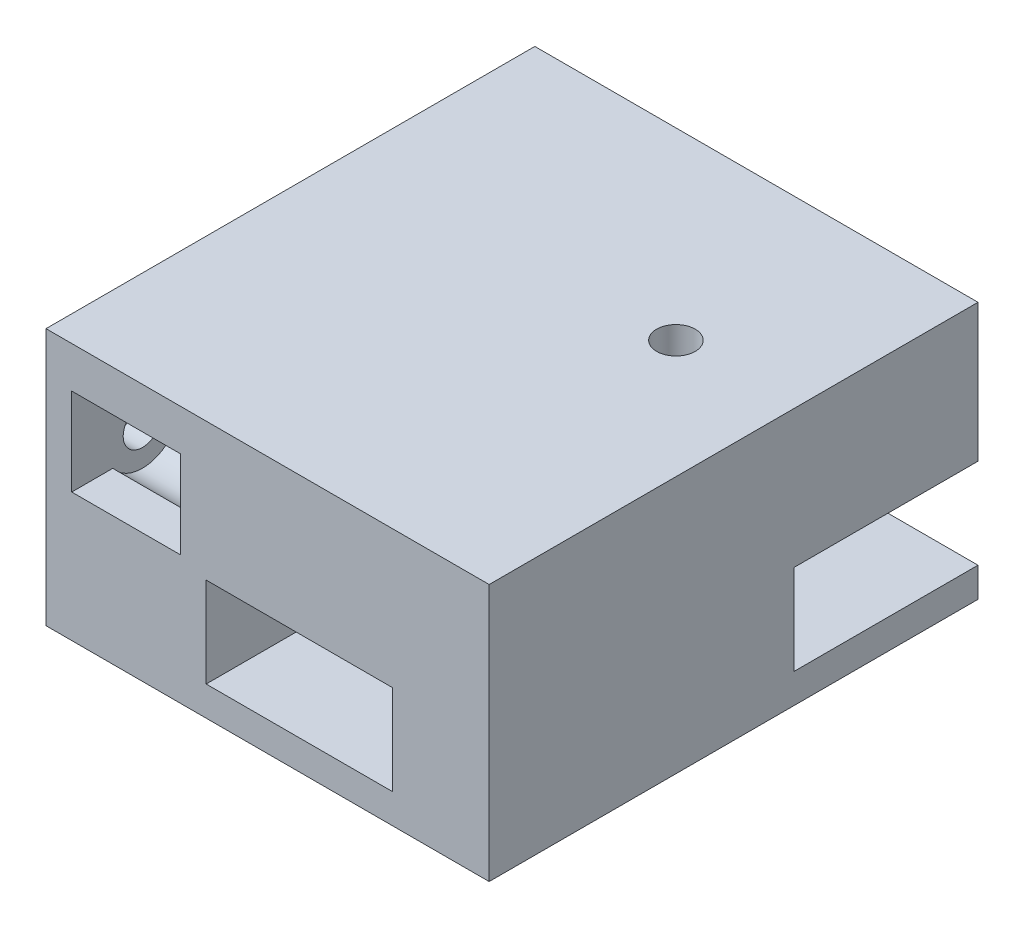
ISO-10303-21;
HEADER;
FILE_DESCRIPTION(('STEP AP214'),'2;1');
FILE_NAME('part.step','',(''),(''),'','','');
FILE_SCHEMA(('AUTOMOTIVE_DESIGN { 1 0 10303 214 1 1 1 1 }'));
ENDSEC;
DATA;
#1=APPLICATION_CONTEXT('core data for automotive mechanical design processes');
#2=APPLICATION_PROTOCOL_DEFINITION('international standard','automotive_design',2000,#1);
#3=PRODUCT_CONTEXT('',#1,'mechanical');
#4=PRODUCT('Part','Part','',(#3));
#5=PRODUCT_RELATED_PRODUCT_CATEGORY('part','',(#4));
#6=PRODUCT_DEFINITION_FORMATION('','',#4);
#7=PRODUCT_DEFINITION_CONTEXT('part definition',#1,'design');
#8=PRODUCT_DEFINITION('design','',#6,#7);
#9=PRODUCT_DEFINITION_SHAPE('','',#8);
#10=(LENGTH_UNIT() NAMED_UNIT(*) SI_UNIT(.MILLI.,.METRE.));
#11=(NAMED_UNIT(*) PLANE_ANGLE_UNIT() SI_UNIT($,.RADIAN.));
#12=(NAMED_UNIT(*) SI_UNIT($,.STERADIAN.) SOLID_ANGLE_UNIT());
#13=UNCERTAINTY_MEASURE_WITH_UNIT(LENGTH_MEASURE(1.E-05),#10,'distance_accuracy_value','');
#14=(GEOMETRIC_REPRESENTATION_CONTEXT(3) GLOBAL_UNCERTAINTY_ASSIGNED_CONTEXT((#13)) GLOBAL_UNIT_ASSIGNED_CONTEXT((#10,
#11,#12)) REPRESENTATION_CONTEXT('',''));
#15=CARTESIAN_POINT('',(0.,0.,0.));
#16=DIRECTION('',(0.,0.,1.));
#17=DIRECTION('',(1.,0.,0.));
#18=AXIS2_PLACEMENT_3D('',#15,#16,#17);
#19=CARTESIAN_POINT('',(12.125,-500000.,0.));
#20=DIRECTION('',(1.,0.,0.));
#21=DIRECTION('',(0.,0.,-1.));
#22=AXIS2_PLACEMENT_3D('',#19,#20,#21);
#23=PLANE('',#22);
#24=DIRECTION('',(0.,-1.,0.));
#25=VECTOR('',#24,1.);
#26=CARTESIAN_POINT('',(12.125,28.9501505877455,-18.4638204994987));
#27=LINE('',#26,#25);
#28=CARTESIAN_POINT('',(12.125,-2.70000000000437,-18.4638204994987));
#29=VERTEX_POINT('',#28);
#30=CARTESIAN_POINT('',(12.125,4.3,-18.4638204994987));
#31=VERTEX_POINT('',#30);
#32=EDGE_CURVE('E11',#29,#31,#27,.F.);
#33=ORIENTED_EDGE('',*,*,#32,.F.);
#34=DIRECTION('',(0.,0.,1.));
#35=VECTOR('',#34,1.);
#36=CARTESIAN_POINT('',(12.125,-2.70000000000437,0.));
#37=LINE('',#36,#35);
#38=CARTESIAN_POINT('',(12.125,-2.70000000011805,0.));
#39=VERTEX_POINT('',#38);
#40=EDGE_CURVE('E272',#29,#39,#37,.T.);
#41=ORIENTED_EDGE('',*,*,#40,.T.);
#42=DIRECTION('',(0.,1.,0.));
#43=VECTOR('',#42,1.);
#44=CARTESIAN_POINT('',(12.125,-500000.,0.));
#45=LINE('',#44,#43);
#46=CARTESIAN_POINT('',(12.125,4.3,0.));
#47=VERTEX_POINT('',#46);
#48=EDGE_CURVE('E265',#39,#47,#45,.T.);
#49=ORIENTED_EDGE('',*,*,#48,.T.);
#50=DIRECTION('',(0.,0.,-1.));
#51=VECTOR('',#50,1.);
#52=CARTESIAN_POINT('',(12.125,4.3,0.));
#53=LINE('',#52,#51);
#54=EDGE_CURVE('E271',#47,#31,#53,.T.);
#55=ORIENTED_EDGE('',*,*,#54,.T.);
#56=EDGE_LOOP('',(#33,#41,#49,#55));
#57=FACE_BOUND('',#56,.T.);
#58=ADVANCED_FACE('F37',(#57),#23,.F.);
#59=CARTESIAN_POINT('',(0.,5.,-38.));
#60=DIRECTION('',(0.,1.,0.));
#61=DIRECTION('',(-1.,0.,0.));
#62=AXIS2_PLACEMENT_3D('',#59,#60,#61);
#63=PLANE('',#62);
#64=DIRECTION('',(-1.,0.,0.));
#65=VECTOR('',#64,1.);
#66=CARTESIAN_POINT('',(3.82743866176395,5.,-7.81246621596943));
#67=LINE('',#66,#65);
#68=CARTESIAN_POINT('',(-4.375,5.,-7.81246621596943));
#69=VERTEX_POINT('',#68);
#70=CARTESIAN_POINT('',(-12.825,5.,-7.81246621596943));
#71=VERTEX_POINT('',#70);
#72=EDGE_CURVE('E395',#69,#71,#67,.T.);
#73=ORIENTED_EDGE('',*,*,#72,.F.);
#74=DIRECTION('',(0.,0.,1.));
#75=VECTOR('',#74,1.);
#76=CARTESIAN_POINT('',(-4.375,5.,-38.));
#77=LINE('',#76,#75);
#78=CARTESIAN_POINT('',(-4.375,5.,-38.));
#79=VERTEX_POINT('',#78);
#80=EDGE_CURVE('E294',#79,#69,#77,.T.);
#81=ORIENTED_EDGE('',*,*,#80,.F.);
#82=DIRECTION('',(-1.,0.,0.));
#83=VECTOR('',#82,1.);
#84=CARTESIAN_POINT('',(0.,5.,-38.));
#85=LINE('',#84,#83);
#86=CARTESIAN_POINT('',(-12.825,5.,-38.));
#87=VERTEX_POINT('',#86);
#88=EDGE_CURVE('E219',#79,#87,#85,.T.);
#89=ORIENTED_EDGE('',*,*,#88,.T.);
#90=DIRECTION('',(0.,0.,-1.));
#91=VECTOR('',#90,1.);
#92=CARTESIAN_POINT('',(-12.825,5.,-38.));
#93=LINE('',#92,#91);
#94=EDGE_CURVE('E282',#71,#87,#93,.T.);
#95=ORIENTED_EDGE('',*,*,#94,.F.);
#96=EDGE_LOOP('',(#73,#81,#89,#95));
#97=FACE_BOUND('',#96,.T.);
#98=ADVANCED_FACE('F418',(#97),#63,.T.);
#99=CARTESIAN_POINT('',(0.,-2.7,-38.));
#100=DIRECTION('',(0.,1.,0.));
#101=DIRECTION('',(-1.,0.,0.));
#102=AXIS2_PLACEMENT_3D('',#99,#100,#101);
#103=PLANE('',#102);
#104=CARTESIAN_POINT('',(10.44201924,-2.7,-23.7));
#105=DIRECTION('',(0.,1.,0.));
#106=DIRECTION('',(-1.,0.,0.));
#107=AXIS2_PLACEMENT_3D('',#104,#105,#106);
#108=CIRCLE('',#107,1.5);
#109=CARTESIAN_POINT('',(8.94201924000001,-2.7,-23.7));
#110=VERTEX_POINT('',#109);
#111=EDGE_CURVE('E311',#110,#110,#108,.F.);
#112=ORIENTED_EDGE('',*,*,#111,.T.);
#113=EDGE_LOOP('',(#112));
#114=FACE_BOUND('',#113,.T.);
#115=DIRECTION('',(-1.,0.,0.));
#116=VECTOR('',#115,1.);
#117=CARTESIAN_POINT('',(0.,-2.7,-38.));
#118=LINE('',#117,#116);
#119=CARTESIAN_POINT('',(19.625,-2.7,-38.));
#120=VERTEX_POINT('',#119);
#121=CARTESIAN_POINT('',(-2.375,-2.7,-38.));
#122=VERTEX_POINT('',#121);
#123=EDGE_CURVE('E192',#120,#122,#118,.T.);
#124=ORIENTED_EDGE('',*,*,#123,.T.);
#125=DIRECTION('',(0.,0.,1.));
#126=VECTOR('',#125,1.);
#127=CARTESIAN_POINT('',(-2.375,-2.7,-38.));
#128=LINE('',#127,#126);
#129=CARTESIAN_POINT('',(-2.375,-2.7,0.));
#130=VERTEX_POINT('',#129);
#131=EDGE_CURVE('E45',#122,#130,#128,.T.);
#132=ORIENTED_EDGE('',*,*,#131,.T.);
#133=DIRECTION('',(-1.,0.,0.));
#134=VECTOR('',#133,1.);
#135=CARTESIAN_POINT('',(0.,-2.7,0.));
#136=LINE('',#135,#134);
#137=EDGE_CURVE('E207',#39,#130,#136,.T.);
#138=ORIENTED_EDGE('',*,*,#137,.F.);
#139=ORIENTED_EDGE('',*,*,#40,.F.);
#140=CARTESIAN_POINT('',(10.44201924,-2.7,-23.7));
#141=DIRECTION('',(0.,1.,0.));
#142=DIRECTION('',(-1.,0.,0.));
#143=AXIS2_PLACEMENT_3D('',#140,#141,#142);
#144=CIRCLE('',#143,5.5);
#145=CARTESIAN_POINT('',(15.94201924,-2.7,-23.7));
#146=VERTEX_POINT('',#145);
#147=EDGE_CURVE('E51',#29,#146,#144,.T.);
#148=ORIENTED_EDGE('',*,*,#147,.T.);
#149=DIRECTION('',(1.,0.,0.));
#150=VECTOR('',#149,1.);
#151=CARTESIAN_POINT('',(0.,-2.7,-23.7));
#152=LINE('',#151,#150);
#153=CARTESIAN_POINT('',(19.625,-2.7,-23.7));
#154=VERTEX_POINT('',#153);
#155=EDGE_CURVE('E194',#146,#154,#152,.T.);
#156=ORIENTED_EDGE('',*,*,#155,.T.);
#157=DIRECTION('',(0.,0.,-1.));
#158=VECTOR('',#157,1.);
#159=CARTESIAN_POINT('',(19.625,-2.7,0.));
#160=LINE('',#159,#158);
#161=EDGE_CURVE('E179',#154,#120,#160,.T.);
#162=ORIENTED_EDGE('',*,*,#161,.T.);
#163=EDGE_LOOP('',(#124,#132,#138,#139,#148,#156,#162));
#164=FACE_BOUND('',#163,.T.);
#165=ADVANCED_FACE('F39',(#114,#164),#103,.T.);
#166=CARTESIAN_POINT('',(0.,4.3,-38.));
#167=DIRECTION('',(0.,1.,0.));
#168=DIRECTION('',(0.,0.,1.));
#169=AXIS2_PLACEMENT_3D('',#166,#167,#168);
#170=PLANE('',#169);
#171=DIRECTION('',(0.,0.,1.));
#172=VECTOR('',#171,1.);
#173=CARTESIAN_POINT('',(-2.375,4.3,-38.));
#174=LINE('',#173,#172);
#175=CARTESIAN_POINT('',(-2.375,4.3,-38.));
#176=VERTEX_POINT('',#175);
#177=CARTESIAN_POINT('',(-2.375,4.3,0.));
#178=VERTEX_POINT('',#177);
#179=EDGE_CURVE('E226',#176,#178,#174,.T.);
#180=ORIENTED_EDGE('',*,*,#179,.F.);
#181=DIRECTION('',(-1.,0.,0.));
#182=VECTOR('',#181,1.);
#183=CARTESIAN_POINT('',(0.,4.3,-38.));
#184=LINE('',#183,#182);
#185=CARTESIAN_POINT('',(19.625,4.3,-38.));
#186=VERTEX_POINT('',#185);
#187=EDGE_CURVE('E339',#186,#176,#184,.T.);
#188=ORIENTED_EDGE('',*,*,#187,.F.);
#189=DIRECTION('',(0.,0.,-1.));
#190=VECTOR('',#189,1.);
#191=CARTESIAN_POINT('',(19.625,4.3,0.));
#192=LINE('',#191,#190);
#193=CARTESIAN_POINT('',(19.625,4.3,-23.7));
#194=VERTEX_POINT('',#193);
#195=EDGE_CURVE('E371',#194,#186,#192,.T.);
#196=ORIENTED_EDGE('',*,*,#195,.F.);
#197=DIRECTION('',(1.,0.,0.));
#198=VECTOR('',#197,1.);
#199=CARTESIAN_POINT('',(0.,4.3,-23.7));
#200=LINE('',#199,#198);
#201=CARTESIAN_POINT('',(15.94201924,4.3,-23.7));
#202=VERTEX_POINT('',#201);
#203=EDGE_CURVE('E376',#202,#194,#200,.T.);
#204=ORIENTED_EDGE('',*,*,#203,.F.);
#205=CARTESIAN_POINT('',(10.44201924,4.3,-23.7));
#206=DIRECTION('',(0.,1.,0.));
#207=DIRECTION('',(0.,0.,1.));
#208=AXIS2_PLACEMENT_3D('',#205,#206,#207);
#209=CIRCLE('',#208,5.5);
#210=EDGE_CURVE('E381',#31,#202,#209,.T.);
#211=ORIENTED_EDGE('',*,*,#210,.F.);
#212=ORIENTED_EDGE('',*,*,#54,.F.);
#213=DIRECTION('',(-1.,0.,0.));
#214=VECTOR('',#213,1.);
#215=CARTESIAN_POINT('',(0.,4.3,0.));
#216=LINE('',#215,#214);
#217=EDGE_CURVE('E267',#47,#178,#216,.T.);
#218=ORIENTED_EDGE('',*,*,#217,.T.);
#219=EDGE_LOOP('',(#180,#188,#196,#204,#211,#212,#218));
#220=FACE_BOUND('',#219,.T.);
#221=CARTESIAN_POINT('',(10.44201924,4.3,-23.7));
#222=DIRECTION('',(0.,1.,0.));
#223=DIRECTION('',(0.,0.,1.));
#224=AXIS2_PLACEMENT_3D('',#221,#222,#223);
#225=CIRCLE('',#224,1.5);
#226=CARTESIAN_POINT('',(10.44201924,4.3,-22.2));
#227=VERTEX_POINT('',#226);
#228=EDGE_CURVE('E310',#227,#227,#225,.F.);
#229=ORIENTED_EDGE('',*,*,#228,.F.);
#230=EDGE_LOOP('',(#229));
#231=FACE_BOUND('',#230,.T.);
#232=ADVANCED_FACE('F378',(#220,#231),#170,.F.);
#233=DIRECTION('',(-1.,0.,0.));
#234=VECTOR('',#233,1.);
#235=CARTESIAN_POINT('',(3.82743866176395,5.,-3.18753378403057));
#236=LINE('',#235,#234);
#237=CARTESIAN_POINT('',(-12.825,5.,-3.18753378403057));
#238=VERTEX_POINT('',#237);
#239=CARTESIAN_POINT('',(-4.375,5.,-3.18753378403057));
#240=VERTEX_POINT('',#239);
#241=EDGE_CURVE('E393',#238,#240,#236,.F.);
#242=ORIENTED_EDGE('',*,*,#241,.F.);
#243=CARTESIAN_POINT('',(-12.825,5.,0.));
#244=VERTEX_POINT('',#243);
#245=EDGE_CURVE('E284',#244,#238,#93,.T.);
#246=ORIENTED_EDGE('',*,*,#245,.F.);
#247=DIRECTION('',(-1.,0.,0.));
#248=VECTOR('',#247,1.);
#249=CARTESIAN_POINT('',(0.,5.,0.));
#250=LINE('',#249,#248);
#251=CARTESIAN_POINT('',(-4.375,5.,0.));
#252=VERTEX_POINT('',#251);
#253=EDGE_CURVE('E240',#252,#244,#250,.T.);
#254=ORIENTED_EDGE('',*,*,#253,.F.);
#255=EDGE_CURVE('E293',#240,#252,#77,.T.);
#256=ORIENTED_EDGE('',*,*,#255,.F.);
#257=EDGE_LOOP('',(#242,#246,#254,#256));
#258=FACE_BOUND('',#257,.T.);
#259=ADVANCED_FACE('F424',(#258),#63,.T.);
#260=CARTESIAN_POINT('',(0.,11.8,-38.));
#261=DIRECTION('',(0.,1.,0.));
#262=DIRECTION('',(-1.,0.,0.));
#263=AXIS2_PLACEMENT_3D('',#260,#261,#262);
#264=PLANE('',#263);
#265=DIRECTION('',(0.,0.,-1.));
#266=VECTOR('',#265,1.);
#267=CARTESIAN_POINT('',(-12.825,11.7999999999938,-38.));
#268=LINE('',#267,#266);
#269=CARTESIAN_POINT('',(-12.825,11.7999999999938,0.));
#270=VERTEX_POINT('',#269);
#271=CARTESIAN_POINT('',(-12.825,11.7999999999938,-38.));
#272=VERTEX_POINT('',#271);
#273=EDGE_CURVE('E289',#270,#272,#268,.T.);
#274=ORIENTED_EDGE('',*,*,#273,.T.);
#275=DIRECTION('',(-1.,0.,0.));
#276=VECTOR('',#275,1.);
#277=CARTESIAN_POINT('',(0.,11.8,-38.));
#278=LINE('',#277,#276);
#279=CARTESIAN_POINT('',(-4.375,11.8,-38.));
#280=VERTEX_POINT('',#279);
#281=EDGE_CURVE('E332',#280,#272,#278,.T.);
#282=ORIENTED_EDGE('',*,*,#281,.F.);
#283=DIRECTION('',(0.,0.,1.));
#284=VECTOR('',#283,1.);
#285=CARTESIAN_POINT('',(-4.375,11.7999999999938,-38.));
#286=LINE('',#285,#284);
#287=CARTESIAN_POINT('',(-4.375,11.7999999999938,0.));
#288=VERTEX_POINT('',#287);
#289=EDGE_CURVE('E301',#280,#288,#286,.T.);
#290=ORIENTED_EDGE('',*,*,#289,.T.);
#291=DIRECTION('',(-1.,0.,0.));
#292=VECTOR('',#291,1.);
#293=CARTESIAN_POINT('',(0.,11.8,0.));
#294=LINE('',#293,#292);
#295=EDGE_CURVE('E331',#288,#270,#294,.T.);
#296=ORIENTED_EDGE('',*,*,#295,.T.);
#297=EDGE_LOOP('',(#274,#282,#290,#296));
#298=FACE_BOUND('',#297,.T.);
#299=ADVANCED_FACE('F582',(#298),#264,.F.);
#300=CARTESIAN_POINT('',(-9.825,0.,-38.));
#301=DIRECTION('',(-1.,0.,0.));
#302=DIRECTION('',(0.,0.,1.));
#303=AXIS2_PLACEMENT_3D('',#300,#301,#302);
#304=PLANE('',#303);
#305=DIRECTION('',(0.,0.,1.));
#306=VECTOR('',#305,1.);
#307=CARTESIAN_POINT('',(-9.825,-5.,-38.));
#308=LINE('',#307,#306);
#309=CARTESIAN_POINT('',(-9.825,-5.,-38.));
#310=VERTEX_POINT('',#309);
#311=CARTESIAN_POINT('',(-9.825,-5.,-16.));
#312=VERTEX_POINT('',#311);
#313=EDGE_CURVE('E245',#310,#312,#308,.T.);
#314=ORIENTED_EDGE('',*,*,#313,.T.);
#315=DIRECTION('',(0.,-1.,0.));
#316=VECTOR('',#315,1.);
#317=CARTESIAN_POINT('',(-9.825,0.,-16.));
#318=LINE('',#317,#316);
#319=CARTESIAN_POINT('',(-9.825,-2.,-16.));
#320=VERTEX_POINT('',#319);
#321=EDGE_CURVE('E186',#320,#312,#318,.T.);
#322=ORIENTED_EDGE('',*,*,#321,.F.);
#323=DIRECTION('',(0.,0.,1.));
#324=VECTOR('',#323,1.);
#325=CARTESIAN_POINT('',(-9.825,-2.,-38.));
#326=LINE('',#325,#324);
#327=CARTESIAN_POINT('',(-9.825,-2.,-38.));
#328=VERTEX_POINT('',#327);
#329=EDGE_CURVE('E248',#328,#320,#326,.T.);
#330=ORIENTED_EDGE('',*,*,#329,.F.);
#331=DIRECTION('',(0.,-1.,0.));
#332=VECTOR('',#331,1.);
#333=CARTESIAN_POINT('',(-9.825,0.,-38.));
#334=LINE('',#333,#332);
#335=EDGE_CURVE('E235',#328,#310,#334,.T.);
#336=ORIENTED_EDGE('',*,*,#335,.T.);
#337=EDGE_LOOP('',(#314,#322,#330,#336));
#338=FACE_BOUND('',#337,.T.);
#339=ADVANCED_FACE('F363',(#338),#304,.T.);
#340=CARTESIAN_POINT('',(0.,-2.,-38.));
#341=DIRECTION('',(0.,-1.,0.));
#342=DIRECTION('',(0.,0.,-1.));
#343=AXIS2_PLACEMENT_3D('',#340,#341,#342);
#344=PLANE('',#343);
#345=ORIENTED_EDGE('',*,*,#329,.T.);
#346=DIRECTION('',(1.,0.,0.));
#347=VECTOR('',#346,1.);
#348=CARTESIAN_POINT('',(0.,-2.,-16.));
#349=LINE('',#348,#347);
#350=CARTESIAN_POINT('',(-14.825,-2.,-16.));
#351=VERTEX_POINT('',#350);
#352=EDGE_CURVE('E321',#351,#320,#349,.T.);
#353=ORIENTED_EDGE('',*,*,#352,.F.);
#354=DIRECTION('',(0.,0.,1.));
#355=VECTOR('',#354,1.);
#356=CARTESIAN_POINT('',(-14.825,-2.,-38.));
#357=LINE('',#356,#355);
#358=CARTESIAN_POINT('',(-14.825,-2.,-38.));
#359=VERTEX_POINT('',#358);
#360=EDGE_CURVE('E237',#359,#351,#357,.T.);
#361=ORIENTED_EDGE('',*,*,#360,.F.);
#362=DIRECTION('',(1.,0.,0.));
#363=VECTOR('',#362,1.);
#364=CARTESIAN_POINT('',(0.,-2.,-38.));
#365=LINE('',#364,#363);
#366=EDGE_CURVE('E233',#359,#328,#365,.T.);
#367=ORIENTED_EDGE('',*,*,#366,.T.);
#368=EDGE_LOOP('',(#345,#353,#361,#367));
#369=FACE_BOUND('',#368,.T.);
#370=ADVANCED_FACE('F367',(#369),#344,.T.);
#371=CARTESIAN_POINT('',(-2.375,0.,-38.));
#372=DIRECTION('',(-1.,0.,0.));
#373=DIRECTION('',(0.,-1.,0.));
#374=AXIS2_PLACEMENT_3D('',#371,#372,#373);
#375=PLANE('',#374);
#376=ORIENTED_EDGE('',*,*,#179,.T.);
#377=DIRECTION('',(0.,-1.,0.));
#378=VECTOR('',#377,1.);
#379=CARTESIAN_POINT('',(-2.375,0.,0.));
#380=LINE('',#379,#378);
#381=EDGE_CURVE('E221',#178,#130,#380,.T.);
#382=ORIENTED_EDGE('',*,*,#381,.T.);
#383=ORIENTED_EDGE('',*,*,#131,.F.);
#384=DIRECTION('',(0.,-1.,0.));
#385=VECTOR('',#384,1.);
#386=CARTESIAN_POINT('',(-2.375,0.,-38.));
#387=LINE('',#386,#385);
#388=EDGE_CURVE('E201',#176,#122,#387,.T.);
#389=ORIENTED_EDGE('',*,*,#388,.F.);
#390=EDGE_LOOP('',(#376,#382,#383,#389));
#391=FACE_BOUND('',#390,.T.);
#392=ADVANCED_FACE('F258',(#391),#375,.F.);
#393=CARTESIAN_POINT('',(0.,-5.,-38.));
#394=DIRECTION('',(0.,1.,0.));
#395=DIRECTION('',(-1.,0.,0.));
#396=AXIS2_PLACEMENT_3D('',#393,#394,#395);
#397=PLANE('',#396);
#398=CARTESIAN_POINT('',(10.44201924,-5.,-23.7));
#399=DIRECTION('',(0.,1.,0.));
#400=DIRECTION('',(-1.,0.,0.));
#401=AXIS2_PLACEMENT_3D('',#398,#399,#400);
#402=CIRCLE('',#401,1.5);
#403=CARTESIAN_POINT('',(8.94201924000001,-5.,-23.7));
#404=VERTEX_POINT('',#403);
#405=EDGE_CURVE('E304',#404,#404,#402,.F.);
#406=ORIENTED_EDGE('',*,*,#405,.F.);
#407=EDGE_LOOP('',(#406));
#408=FACE_BOUND('',#407,.T.);
#409=DIRECTION('',(-1.,0.,0.));
#410=VECTOR('',#409,1.);
#411=CARTESIAN_POINT('',(0.,-5.,0.));
#412=LINE('',#411,#410);
#413=CARTESIAN_POINT('',(19.625,-5.,0.));
#414=VERTEX_POINT('',#413);
#415=CARTESIAN_POINT('',(-14.825,-5.,0.));
#416=VERTEX_POINT('',#415);
#417=EDGE_CURVE('E204',#414,#416,#412,.T.);
#418=ORIENTED_EDGE('',*,*,#417,.T.);
#419=DIRECTION('',(0.,0.,1.));
#420=VECTOR('',#419,1.);
#421=CARTESIAN_POINT('',(-14.825,-5.,-16.));
#422=LINE('',#421,#420);
#423=CARTESIAN_POINT('',(-14.825,-5.,-16.));
#424=VERTEX_POINT('',#423);
#425=EDGE_CURVE('E328',#424,#416,#422,.T.);
#426=ORIENTED_EDGE('',*,*,#425,.F.);
#427=DIRECTION('',(-1.,0.,0.));
#428=VECTOR('',#427,1.);
#429=CARTESIAN_POINT('',(0.,-5.,-16.));
#430=LINE('',#429,#428);
#431=EDGE_CURVE('E325',#312,#424,#430,.T.);
#432=ORIENTED_EDGE('',*,*,#431,.F.);
#433=ORIENTED_EDGE('',*,*,#313,.F.);
#434=DIRECTION('',(-1.,0.,0.));
#435=VECTOR('',#434,1.);
#436=CARTESIAN_POINT('',(0.,-5.,-38.));
#437=LINE('',#436,#435);
#438=CARTESIAN_POINT('',(19.625,-5.,-38.));
#439=VERTEX_POINT('',#438);
#440=EDGE_CURVE('E203',#439,#310,#437,.T.);
#441=ORIENTED_EDGE('',*,*,#440,.F.);
#442=DIRECTION('',(0.,0.,-1.));
#443=VECTOR('',#442,1.);
#444=CARTESIAN_POINT('',(19.625,-5.,0.));
#445=LINE('',#444,#443);
#446=EDGE_CURVE('E182',#414,#439,#445,.T.);
#447=ORIENTED_EDGE('',*,*,#446,.F.);
#448=EDGE_LOOP('',(#418,#426,#432,#433,#441,#447));
#449=FACE_BOUND('',#448,.T.);
#450=ADVANCED_FACE('F357',(#408,#449),#397,.F.);
#451=CARTESIAN_POINT('',(0.,0.,-38.));
#452=DIRECTION('',(0.,0.,1.));
#453=DIRECTION('',(1.,0.,0.));
#454=AXIS2_PLACEMENT_3D('',#451,#452,#453);
#455=PLANE('',#454);
#456=DIRECTION('',(0.,1.,0.));
#457=VECTOR('',#456,1.);
#458=CARTESIAN_POINT('',(19.625,-2.7,-38.));
#459=LINE('',#458,#457);
#460=CARTESIAN_POINT('',(19.625,15.,-38.));
#461=VERTEX_POINT('',#460);
#462=EDGE_CURVE('E187',#186,#461,#459,.T.);
#463=ORIENTED_EDGE('',*,*,#462,.F.);
#464=ORIENTED_EDGE('',*,*,#187,.T.);
#465=ORIENTED_EDGE('',*,*,#388,.T.);
#466=ORIENTED_EDGE('',*,*,#123,.F.);
#467=EDGE_CURVE('E175',#439,#120,#459,.T.);
#468=ORIENTED_EDGE('',*,*,#467,.F.);
#469=ORIENTED_EDGE('',*,*,#440,.T.);
#470=ORIENTED_EDGE('',*,*,#335,.F.);
#471=ORIENTED_EDGE('',*,*,#366,.F.);
#472=DIRECTION('',(0.,1.,0.));
#473=VECTOR('',#472,1.);
#474=CARTESIAN_POINT('',(-14.825,0.,-38.));
#475=LINE('',#474,#473);
#476=CARTESIAN_POINT('',(-14.825,15.,-38.));
#477=VERTEX_POINT('',#476);
#478=EDGE_CURVE('E230',#359,#477,#475,.T.);
#479=ORIENTED_EDGE('',*,*,#478,.T.);
#480=DIRECTION('',(-1.,0.,0.));
#481=VECTOR('',#480,1.);
#482=CARTESIAN_POINT('',(0.,15.,-38.));
#483=LINE('',#482,#481);
#484=EDGE_CURVE('E341',#461,#477,#483,.T.);
#485=ORIENTED_EDGE('',*,*,#484,.F.);
#486=EDGE_LOOP('',(#463,#464,#465,#466,#468,#469,#470,#471,#479,#485));
#487=FACE_BOUND('',#486,.T.);
#488=ORIENTED_EDGE('',*,*,#88,.F.);
#489=DIRECTION('',(0.,-1.,0.));
#490=VECTOR('',#489,1.);
#491=CARTESIAN_POINT('',(-4.3750000001045,500000.,-38.));
#492=LINE('',#491,#490);
#493=EDGE_CURVE('E299',#280,#79,#492,.T.);
#494=ORIENTED_EDGE('',*,*,#493,.F.);
#495=ORIENTED_EDGE('',*,*,#281,.T.);
#496=DIRECTION('',(0.,-1.,0.));
#497=VECTOR('',#496,1.);
#498=CARTESIAN_POINT('',(-12.8250000001045,500000.,-38.));
#499=LINE('',#498,#497);
#500=EDGE_CURVE('E286',#272,#87,#499,.T.);
#501=ORIENTED_EDGE('',*,*,#500,.T.);
#502=EDGE_LOOP('',(#488,#494,#495,#501));
#503=FACE_BOUND('',#502,.T.);
#504=ADVANCED_FACE('F198',(#487,#503),#455,.F.);
#505=CARTESIAN_POINT('',(0.,0.,0.));
#506=DIRECTION('',(0.,0.,1.));
#507=DIRECTION('',(1.,0.,0.));
#508=AXIS2_PLACEMENT_3D('',#505,#506,#507);
#509=PLANE('',#508);
#510=ORIENTED_EDGE('',*,*,#48,.F.);
#511=ORIENTED_EDGE('',*,*,#137,.T.);
#512=ORIENTED_EDGE('',*,*,#381,.F.);
#513=ORIENTED_EDGE('',*,*,#217,.F.);
#514=EDGE_LOOP('',(#510,#511,#512,#513));
#515=FACE_BOUND('',#514,.T.);
#516=DIRECTION('',(0.,-1.,0.));
#517=VECTOR('',#516,1.);
#518=CARTESIAN_POINT('',(-12.8250000001045,500000.,0.));
#519=LINE('',#518,#517);
#520=EDGE_CURVE('E287',#270,#244,#519,.T.);
#521=ORIENTED_EDGE('',*,*,#520,.F.);
#522=ORIENTED_EDGE('',*,*,#295,.F.);
#523=DIRECTION('',(0.,-1.,0.));
#524=VECTOR('',#523,1.);
#525=CARTESIAN_POINT('',(-4.3750000001045,500000.,0.));
#526=LINE('',#525,#524);
#527=EDGE_CURVE('E297',#288,#252,#526,.T.);
#528=ORIENTED_EDGE('',*,*,#527,.T.);
#529=ORIENTED_EDGE('',*,*,#253,.T.);
#530=EDGE_LOOP('',(#521,#522,#528,#529));
#531=FACE_BOUND('',#530,.T.);
#532=DIRECTION('',(-1.,0.,0.));
#533=VECTOR('',#532,1.);
#534=CARTESIAN_POINT('',(0.,15.,0.));
#535=LINE('',#534,#533);
#536=CARTESIAN_POINT('',(19.625,15.,0.));
#537=VERTEX_POINT('',#536);
#538=CARTESIAN_POINT('',(-14.825,15.,0.));
#539=VERTEX_POINT('',#538);
#540=EDGE_CURVE('E342',#537,#539,#535,.T.);
#541=ORIENTED_EDGE('',*,*,#540,.T.);
#542=DIRECTION('',(0.,1.,0.));
#543=VECTOR('',#542,1.);
#544=CARTESIAN_POINT('',(-14.825,0.,0.));
#545=LINE('',#544,#543);
#546=EDGE_CURVE('E220',#416,#539,#545,.T.);
#547=ORIENTED_EDGE('',*,*,#546,.F.);
#548=ORIENTED_EDGE('',*,*,#417,.F.);
#549=DIRECTION('',(0.,-1.,0.));
#550=VECTOR('',#549,1.);
#551=CARTESIAN_POINT('',(19.625,-2.7,0.));
#552=LINE('',#551,#550);
#553=EDGE_CURVE('E316',#537,#414,#552,.T.);
#554=ORIENTED_EDGE('',*,*,#553,.F.);
#555=EDGE_LOOP('',(#541,#547,#548,#554));
#556=FACE_BOUND('',#555,.T.);
#557=ADVANCED_FACE('F262',(#515,#531,#556),#509,.T.);
#558=CARTESIAN_POINT('',(-14.825,0.,-38.));
#559=DIRECTION('',(1.,0.,0.));
#560=DIRECTION('',(0.,0.,-1.));
#561=AXIS2_PLACEMENT_3D('',#558,#559,#560);
#562=PLANE('',#561);
#563=CARTESIAN_POINT('',(-14.825,6.75000000000001,-5.5));
#564=DIRECTION('',(-1.,0.,0.));
#565=DIRECTION('',(0.,-1.,0.));
#566=AXIS2_PLACEMENT_3D('',#563,#564,#565);
#567=CIRCLE('',#566,1.5);
#568=CARTESIAN_POINT('',(-14.825,5.25000000000001,-5.5));
#569=VERTEX_POINT('',#568);
#570=EDGE_CURVE('E275',#569,#569,#567,.T.);
#571=ORIENTED_EDGE('',*,*,#570,.F.);
#572=EDGE_LOOP('',(#571));
#573=FACE_BOUND('',#572,.T.);
#574=ORIENTED_EDGE('',*,*,#546,.T.);
#575=DIRECTION('',(0.,0.,1.));
#576=VECTOR('',#575,1.);
#577=CARTESIAN_POINT('',(-14.825,15.,-38.));
#578=LINE('',#577,#576);
#579=EDGE_CURVE('E335',#477,#539,#578,.T.);
#580=ORIENTED_EDGE('',*,*,#579,.F.);
#581=ORIENTED_EDGE('',*,*,#478,.F.);
#582=ORIENTED_EDGE('',*,*,#360,.T.);
#583=DIRECTION('',(0.,1.,0.));
#584=VECTOR('',#583,1.);
#585=CARTESIAN_POINT('',(-14.825,0.,-16.));
#586=LINE('',#585,#584);
#587=EDGE_CURVE('E323',#424,#351,#586,.T.);
#588=ORIENTED_EDGE('',*,*,#587,.F.);
#589=ORIENTED_EDGE('',*,*,#425,.T.);
#590=EDGE_LOOP('',(#574,#580,#581,#582,#588,#589));
#591=FACE_BOUND('',#590,.T.);
#592=ADVANCED_FACE('F354',(#573,#591),#562,.F.);
#593=CARTESIAN_POINT('',(0.,15.,-38.));
#594=DIRECTION('',(0.,1.,0.));
#595=DIRECTION('',(-1.,0.,0.));
#596=AXIS2_PLACEMENT_3D('',#593,#594,#595);
#597=PLANE('',#596);
#598=CARTESIAN_POINT('',(10.44201924,15.,-23.7));
#599=DIRECTION('',(0.,1.,0.));
#600=DIRECTION('',(-1.,0.,0.));
#601=AXIS2_PLACEMENT_3D('',#598,#599,#600);
#602=CIRCLE('',#601,1.5);
#603=CARTESIAN_POINT('',(8.94201924,15.,-23.7));
#604=VERTEX_POINT('',#603);
#605=EDGE_CURVE('E307',#604,#604,#602,.T.);
#606=ORIENTED_EDGE('',*,*,#605,.F.);
#607=EDGE_LOOP('',(#606));
#608=FACE_BOUND('',#607,.T.);
#609=ORIENTED_EDGE('',*,*,#540,.F.);
#610=DIRECTION('',(0.,0.,1.));
#611=VECTOR('',#610,1.);
#612=CARTESIAN_POINT('',(19.625,15.,0.));
#613=LINE('',#612,#611);
#614=EDGE_CURVE('E314',#461,#537,#613,.T.);
#615=ORIENTED_EDGE('',*,*,#614,.F.);
#616=ORIENTED_EDGE('',*,*,#484,.T.);
#617=ORIENTED_EDGE('',*,*,#579,.T.);
#618=EDGE_LOOP('',(#609,#615,#616,#617));
#619=FACE_BOUND('',#618,.T.);
#620=ADVANCED_FACE('F351',(#608,#619),#597,.T.);
#621=CARTESIAN_POINT('',(0.,0.,-16.));
#622=DIRECTION('',(0.,0.,1.));
#623=DIRECTION('',(1.,0.,0.));
#624=AXIS2_PLACEMENT_3D('',#621,#622,#623);
#625=PLANE('',#624);
#626=ORIENTED_EDGE('',*,*,#321,.T.);
#627=ORIENTED_EDGE('',*,*,#431,.T.);
#628=ORIENTED_EDGE('',*,*,#587,.T.);
#629=ORIENTED_EDGE('',*,*,#352,.T.);
#630=EDGE_LOOP('',(#626,#627,#628,#629));
#631=FACE_BOUND('',#630,.T.);
#632=ADVANCED_FACE('F492',(#631),#625,.F.);
#633=CARTESIAN_POINT('',(19.625,0.,0.));
#634=DIRECTION('',(1.,0.,0.));
#635=DIRECTION('',(0.,0.,-1.));
#636=AXIS2_PLACEMENT_3D('',#633,#634,#635);
#637=PLANE('',#636);
#638=ORIENTED_EDGE('',*,*,#195,.T.);
#639=ORIENTED_EDGE('',*,*,#462,.T.);
#640=ORIENTED_EDGE('',*,*,#614,.T.);
#641=ORIENTED_EDGE('',*,*,#553,.T.);
#642=ORIENTED_EDGE('',*,*,#446,.T.);
#643=ORIENTED_EDGE('',*,*,#467,.T.);
#644=ORIENTED_EDGE('',*,*,#161,.F.);
#645=DIRECTION('',(0.,-1.,0.));
#646=VECTOR('',#645,1.);
#647=CARTESIAN_POINT('',(19.625,28.9501505877455,-23.7));
#648=LINE('',#647,#646);
#649=EDGE_CURVE('E196',#194,#154,#648,.T.);
#650=ORIENTED_EDGE('',*,*,#649,.F.);
#651=EDGE_LOOP('',(#638,#639,#640,#641,#642,#643,#644,#650));
#652=FACE_BOUND('',#651,.T.);
#653=ADVANCED_FACE('F178',(#652),#637,.T.);
#654=CARTESIAN_POINT('',(10.44201924,19.2426406871193,-23.7));
#655=DIRECTION('',(0.,-1.,0.));
#656=DIRECTION('',(1.,0.,0.));
#657=AXIS2_PLACEMENT_3D('',#654,#655,#656);
#658=CYLINDRICAL_SURFACE('',#657,1.5);
#659=ORIENTED_EDGE('',*,*,#605,.T.);
#660=EDGE_LOOP('',(#659));
#661=FACE_BOUND('',#660,.T.);
#662=ORIENTED_EDGE('',*,*,#228,.T.);
#663=EDGE_LOOP('',(#662));
#664=FACE_BOUND('',#663,.T.);
#665=ADVANCED_FACE('F474',(#661,#664),#658,.F.);
#666=ORIENTED_EDGE('',*,*,#111,.F.);
#667=EDGE_LOOP('',(#666));
#668=FACE_BOUND('',#667,.T.);
#669=ORIENTED_EDGE('',*,*,#405,.T.);
#670=EDGE_LOOP('',(#669));
#671=FACE_BOUND('',#670,.T.);
#672=ADVANCED_FACE('F413',(#668,#671),#658,.F.);
#673=CARTESIAN_POINT('',(-4.3750000001045,500000.,-38.));
#674=DIRECTION('',(1.,0.,0.));
#675=DIRECTION('',(0.,1.,0.));
#676=AXIS2_PLACEMENT_3D('',#673,#674,#675);
#677=PLANE('',#676);
#678=ORIENTED_EDGE('',*,*,#80,.T.);
#679=CARTESIAN_POINT('',(-4.375,6.75000000000001,-5.5));
#680=DIRECTION('',(1.,0.,0.));
#681=DIRECTION('',(0.,1.,0.));
#682=AXIS2_PLACEMENT_3D('',#679,#680,#681);
#683=CIRCLE('',#682,2.9);
#684=EDGE_CURVE('E391',#69,#240,#683,.F.);
#685=ORIENTED_EDGE('',*,*,#684,.T.);
#686=ORIENTED_EDGE('',*,*,#255,.T.);
#687=ORIENTED_EDGE('',*,*,#527,.F.);
#688=ORIENTED_EDGE('',*,*,#289,.F.);
#689=ORIENTED_EDGE('',*,*,#493,.T.);
#690=EDGE_LOOP('',(#678,#685,#686,#687,#688,#689));
#691=FACE_BOUND('',#690,.T.);
#692=ADVANCED_FACE('F403',(#691),#677,.F.);
#693=CARTESIAN_POINT('',(-12.8250000001045,500000.,-38.));
#694=DIRECTION('',(-1.,0.,0.));
#695=DIRECTION('',(0.,-1.,0.));
#696=AXIS2_PLACEMENT_3D('',#693,#694,#695);
#697=PLANE('',#696);
#698=ORIENTED_EDGE('',*,*,#245,.T.);
#699=CARTESIAN_POINT('',(-12.825,6.75000000000001,-5.5));
#700=DIRECTION('',(-1.,0.,0.));
#701=DIRECTION('',(0.,-1.,0.));
#702=AXIS2_PLACEMENT_3D('',#699,#700,#701);
#703=CIRCLE('',#702,2.9);
#704=EDGE_CURVE('E59',#71,#238,#703,.T.);
#705=ORIENTED_EDGE('',*,*,#704,.F.);
#706=ORIENTED_EDGE('',*,*,#94,.T.);
#707=ORIENTED_EDGE('',*,*,#500,.F.);
#708=ORIENTED_EDGE('',*,*,#273,.F.);
#709=ORIENTED_EDGE('',*,*,#520,.T.);
#710=EDGE_LOOP('',(#698,#705,#706,#707,#708,#709));
#711=FACE_BOUND('',#710,.T.);
#712=CARTESIAN_POINT('',(-12.825,6.75000000000001,-5.5));
#713=DIRECTION('',(-1.,0.,0.));
#714=DIRECTION('',(0.,-1.,0.));
#715=AXIS2_PLACEMENT_3D('',#712,#713,#714);
#716=CIRCLE('',#715,1.5);
#717=CARTESIAN_POINT('',(-12.825,5.25000000000001,-5.5));
#718=VERTEX_POINT('',#717);
#719=EDGE_CURVE('E278',#718,#718,#716,.F.);
#720=ORIENTED_EDGE('',*,*,#719,.F.);
#721=EDGE_LOOP('',(#720));
#722=FACE_BOUND('',#721,.T.);
#723=ADVANCED_FACE('F401',(#711,#722),#697,.F.);
#724=CARTESIAN_POINT('',(19.626,6.75000000000002,-5.5));
#725=DIRECTION('',(-1.,0.,0.));
#726=DIRECTION('',(0.,-1.,0.));
#727=AXIS2_PLACEMENT_3D('',#724,#725,#726);
#728=CYLINDRICAL_SURFACE('',#727,1.5);
#729=ORIENTED_EDGE('',*,*,#570,.T.);
#730=EDGE_LOOP('',(#729));
#731=FACE_BOUND('',#730,.T.);
#732=ORIENTED_EDGE('',*,*,#719,.T.);
#733=EDGE_LOOP('',(#732));
#734=FACE_BOUND('',#733,.T.);
#735=ADVANCED_FACE('F399',(#731,#734),#728,.F.);
#736=CARTESIAN_POINT('',(3.82743866176395,6.75000000000001,-5.5));
#737=DIRECTION('',(-1.,0.,0.));
#738=DIRECTION('',(0.,-1.,0.));
#739=AXIS2_PLACEMENT_3D('',#736,#737,#738);
#740=CYLINDRICAL_SURFACE('',#739,2.9);
#741=ORIENTED_EDGE('',*,*,#72,.T.);
#742=ORIENTED_EDGE('',*,*,#704,.T.);
#743=ORIENTED_EDGE('',*,*,#241,.T.);
#744=ORIENTED_EDGE('',*,*,#684,.F.);
#745=EDGE_LOOP('',(#741,#742,#743,#744));
#746=FACE_BOUND('',#745,.T.);
#747=ADVANCED_FACE('F410',(#746),#740,.F.);
#748=CARTESIAN_POINT('',(10.44201924,28.9501505877455,-23.7));
#749=DIRECTION('',(0.,-1.,0.));
#750=DIRECTION('',(1.,0.,0.));
#751=AXIS2_PLACEMENT_3D('',#748,#749,#750);
#752=CYLINDRICAL_SURFACE('',#751,5.5);
#753=ORIENTED_EDGE('',*,*,#32,.T.);
#754=ORIENTED_EDGE('',*,*,#210,.T.);
#755=DIRECTION('',(0.,-1.,0.));
#756=VECTOR('',#755,1.);
#757=CARTESIAN_POINT('',(15.94201924,28.9501505877455,-23.7));
#758=LINE('',#757,#756);
#759=EDGE_CURVE('E195',#202,#146,#758,.T.);
#760=ORIENTED_EDGE('',*,*,#759,.T.);
#761=ORIENTED_EDGE('',*,*,#147,.F.);
#762=EDGE_LOOP('',(#753,#754,#760,#761));
#763=FACE_BOUND('',#762,.T.);
#764=ADVANCED_FACE('F382',(#763),#752,.F.);
#765=CARTESIAN_POINT('',(0.,28.9501505877455,-23.7));
#766=DIRECTION('',(0.,0.,-1.));
#767=DIRECTION('',(-1.,0.,0.));
#768=AXIS2_PLACEMENT_3D('',#765,#766,#767);
#769=PLANE('',#768);
#770=ORIENTED_EDGE('',*,*,#203,.T.);
#771=ORIENTED_EDGE('',*,*,#649,.T.);
#772=ORIENTED_EDGE('',*,*,#155,.F.);
#773=ORIENTED_EDGE('',*,*,#759,.F.);
#774=EDGE_LOOP('',(#770,#771,#772,#773));
#775=FACE_BOUND('',#774,.T.);
#776=ADVANCED_FACE('F428',(#775),#769,.T.);
#777=CLOSED_SHELL('',(#58,#98,#165,#232,#259,#299,#339,#370,#392,#450,#504,#557,#592,#620,#632,
#653,#665,#672,#692,#723,#735,#747,#764,#776));
#778=MANIFOLD_SOLID_BREP('B2',#777);
#779=ADVANCED_BREP_SHAPE_REPRESENTATION('',(#18,#778),#14);
#780=SHAPE_DEFINITION_REPRESENTATION(#9,#779);
ENDSEC;
END-ISO-10303-21;
